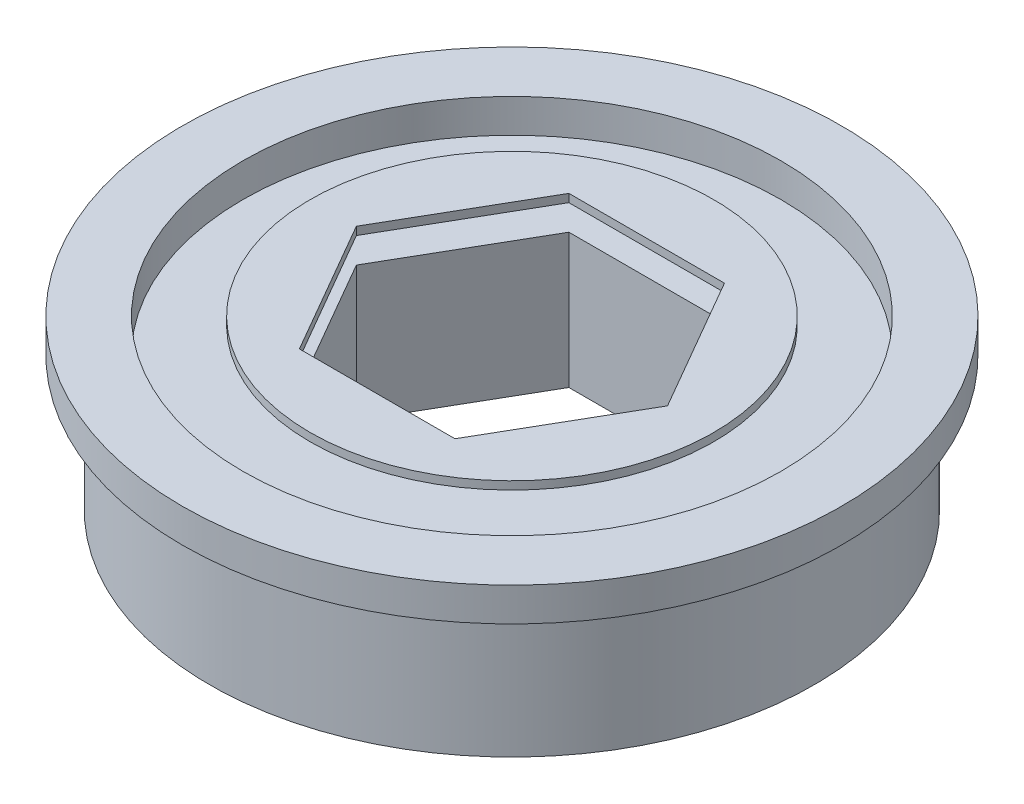
ISO-10303-21;
HEADER;
FILE_DESCRIPTION(('STEP AP214'),'2;1');
FILE_NAME('part.step','',(''),(''),'','','');
FILE_SCHEMA(('AUTOMOTIVE_DESIGN { 1 0 10303 214 1 1 1 1 }'));
ENDSEC;
DATA;
#1=APPLICATION_CONTEXT('core data for automotive mechanical design processes');
#2=APPLICATION_PROTOCOL_DEFINITION('international standard','automotive_design',2000,#1);
#3=PRODUCT_CONTEXT('',#1,'mechanical');
#4=PRODUCT('Part','Part','',(#3));
#5=PRODUCT_RELATED_PRODUCT_CATEGORY('part','',(#4));
#6=PRODUCT_DEFINITION_FORMATION('','',#4);
#7=PRODUCT_DEFINITION_CONTEXT('part definition',#1,'design');
#8=PRODUCT_DEFINITION('design','',#6,#7);
#9=PRODUCT_DEFINITION_SHAPE('','',#8);
#10=(LENGTH_UNIT() NAMED_UNIT(*) SI_UNIT(.MILLI.,.METRE.));
#11=(NAMED_UNIT(*) PLANE_ANGLE_UNIT() SI_UNIT($,.RADIAN.));
#12=(NAMED_UNIT(*) SI_UNIT($,.STERADIAN.) SOLID_ANGLE_UNIT());
#13=UNCERTAINTY_MEASURE_WITH_UNIT(LENGTH_MEASURE(1.E-05),#10,'distance_accuracy_value','');
#14=(GEOMETRIC_REPRESENTATION_CONTEXT(3) GLOBAL_UNCERTAINTY_ASSIGNED_CONTEXT((#13)) GLOBAL_UNIT_ASSIGNED_CONTEXT((#10,
#11,#12)) REPRESENTATION_CONTEXT('',''));
#15=CARTESIAN_POINT('',(0.,0.,0.));
#16=DIRECTION('',(0.,0.,1.));
#17=DIRECTION('',(1.,0.,0.));
#18=AXIS2_PLACEMENT_3D('',#15,#16,#17);
#19=CARTESIAN_POINT('',(0.,7.9375,0.));
#20=DIRECTION('',(0.,-1.,0.));
#21=DIRECTION('',(0.,0.,-1.));
#22=AXIS2_PLACEMENT_3D('',#19,#20,#21);
#23=CYLINDRICAL_SURFACE('',#22,9.525);
#24=CARTESIAN_POINT('',(0.,7.9375,0.));
#25=DIRECTION('',(0.,-1.,0.));
#26=DIRECTION('',(0.,0.,1.));
#27=AXIS2_PLACEMENT_3D('',#24,#25,#26);
#28=CIRCLE('',#27,9.525);
#29=CARTESIAN_POINT('',(0.,7.9375,9.525));
#30=VERTEX_POINT('',#29);
#31=EDGE_CURVE('E168',#30,#30,#28,.T.);
#32=ORIENTED_EDGE('',*,*,#31,.T.);
#33=EDGE_LOOP('',(#32));
#34=FACE_BOUND('',#33,.T.);
#35=CARTESIAN_POINT('',(0.,7.5565,0.));
#36=DIRECTION('',(0.,-1.,0.));
#37=DIRECTION('',(0.,0.,1.));
#38=AXIS2_PLACEMENT_3D('',#35,#36,#37);
#39=CIRCLE('',#38,9.525);
#40=CARTESIAN_POINT('',(0.,7.5565,9.525));
#41=VERTEX_POINT('',#40);
#42=EDGE_CURVE('E154',#41,#41,#39,.T.);
#43=ORIENTED_EDGE('',*,*,#42,.F.);
#44=EDGE_LOOP('',(#43));
#45=FACE_BOUND('',#44,.T.);
#46=ADVANCED_FACE('F51',(#34,#45),#23,.T.);
#47=CARTESIAN_POINT('',(0.,7.9375,0.));
#48=DIRECTION('',(0.,1.,0.));
#49=DIRECTION('',(0.,0.,1.));
#50=AXIS2_PLACEMENT_3D('',#47,#48,#49);
#51=PLANE('',#50);
#52=DIRECTION('',(-1.,0.,0.));
#53=VECTOR('',#52,1.);
#54=CARTESIAN_POINT('',(3.67194771204602,7.9375,6.36));
#55=LINE('',#54,#53);
#56=CARTESIAN_POINT('',(3.67194771204602,7.9375,6.36));
#57=VERTEX_POINT('',#56);
#58=CARTESIAN_POINT('',(-3.67194771204601,7.9375,6.36));
#59=VERTEX_POINT('',#58);
#60=EDGE_CURVE('E119',#57,#59,#55,.T.);
#61=ORIENTED_EDGE('',*,*,#60,.T.);
#62=DIRECTION('',(-0.5,0.,-0.866025403784439));
#63=VECTOR('',#62,1.);
#64=CARTESIAN_POINT('',(-3.67194771204601,7.9375,6.36));
#65=LINE('',#64,#63);
#66=CARTESIAN_POINT('',(-7.34389542409204,7.9375,0.));
#67=VERTEX_POINT('',#66);
#68=EDGE_CURVE('E127',#59,#67,#65,.T.);
#69=ORIENTED_EDGE('',*,*,#68,.T.);
#70=DIRECTION('',(0.5,0.,-0.866025403784439));
#71=VECTOR('',#70,1.);
#72=CARTESIAN_POINT('',(-7.34389542409204,7.9375,0.));
#73=LINE('',#72,#71);
#74=CARTESIAN_POINT('',(-3.67194771204602,7.9375,-6.36));
#75=VERTEX_POINT('',#74);
#76=EDGE_CURVE('E69',#67,#75,#73,.T.);
#77=ORIENTED_EDGE('',*,*,#76,.T.);
#78=DIRECTION('',(1.,0.,0.));
#79=VECTOR('',#78,1.);
#80=CARTESIAN_POINT('',(-3.67194771204602,7.9375,-6.36));
#81=LINE('',#80,#79);
#82=CARTESIAN_POINT('',(3.67194771204602,7.9375,-6.36));
#83=VERTEX_POINT('',#82);
#84=EDGE_CURVE('E142',#75,#83,#81,.T.);
#85=ORIENTED_EDGE('',*,*,#84,.T.);
#86=DIRECTION('',(0.5,0.,0.866025403784438));
#87=VECTOR('',#86,1.);
#88=CARTESIAN_POINT('',(3.67194771204602,7.9375,-6.36));
#89=LINE('',#88,#87);
#90=CARTESIAN_POINT('',(7.34389542409204,7.9375,0.));
#91=VERTEX_POINT('',#90);
#92=EDGE_CURVE('E146',#83,#91,#89,.T.);
#93=ORIENTED_EDGE('',*,*,#92,.T.);
#94=DIRECTION('',(-0.5,0.,0.866025403784439));
#95=VECTOR('',#94,1.);
#96=CARTESIAN_POINT('',(7.34389542409204,7.9375,0.));
#97=LINE('',#96,#95);
#98=EDGE_CURVE('E124',#91,#57,#97,.T.);
#99=ORIENTED_EDGE('',*,*,#98,.T.);
#100=EDGE_LOOP('',(#61,#69,#77,#85,#93,#99));
#101=FACE_BOUND('',#100,.T.);
#102=ORIENTED_EDGE('',*,*,#31,.F.);
#103=EDGE_LOOP('',(#102));
#104=FACE_BOUND('',#103,.T.);
#105=ADVANCED_FACE('F132',(#101,#104),#51,.T.);
#106=CARTESIAN_POINT('',(0.,7.5565,0.));
#107=DIRECTION('',(0.,1.,0.));
#108=DIRECTION('',(0.,0.,1.));
#109=AXIS2_PLACEMENT_3D('',#106,#107,#108);
#110=PLANE('',#109);
#111=DIRECTION('',(0.5,0.,0.866025403784439));
#112=VECTOR('',#111,1.);
#113=CARTESIAN_POINT('',(-5.50792156806903,7.5565,3.18));
#114=LINE('',#113,#112);
#115=CARTESIAN_POINT('',(-7.34389542409204,7.5565,0.));
#116=VERTEX_POINT('',#115);
#117=CARTESIAN_POINT('',(-3.67194771204601,7.5565,6.36));
#118=VERTEX_POINT('',#117);
#119=EDGE_CURVE('E172',#116,#118,#114,.T.);
#120=ORIENTED_EDGE('',*,*,#119,.T.);
#121=DIRECTION('',(1.,0.,0.));
#122=VECTOR('',#121,1.);
#123=CARTESIAN_POINT('',(0.,7.5565,6.36));
#124=LINE('',#123,#122);
#125=CARTESIAN_POINT('',(3.67194771204602,7.5565,6.36));
#126=VERTEX_POINT('',#125);
#127=EDGE_CURVE('E12',#118,#126,#124,.T.);
#128=ORIENTED_EDGE('',*,*,#127,.T.);
#129=DIRECTION('',(0.5,0.,-0.866025403784439));
#130=VECTOR('',#129,1.);
#131=CARTESIAN_POINT('',(5.50792156806903,7.5565,3.18));
#132=LINE('',#131,#130);
#133=CARTESIAN_POINT('',(7.34389542409204,7.5565,0.));
#134=VERTEX_POINT('',#133);
#135=EDGE_CURVE('E59',#126,#134,#132,.T.);
#136=ORIENTED_EDGE('',*,*,#135,.T.);
#137=DIRECTION('',(-0.5,0.,-0.866025403784439));
#138=VECTOR('',#137,1.);
#139=CARTESIAN_POINT('',(5.50792156806903,7.5565,-3.18));
#140=LINE('',#139,#138);
#141=CARTESIAN_POINT('',(3.67194771204602,7.5565,-6.36));
#142=VERTEX_POINT('',#141);
#143=EDGE_CURVE('E186',#134,#142,#140,.T.);
#144=ORIENTED_EDGE('',*,*,#143,.T.);
#145=DIRECTION('',(-1.,0.,0.));
#146=VECTOR('',#145,1.);
#147=CARTESIAN_POINT('',(0.,7.5565,-6.36));
#148=LINE('',#147,#146);
#149=CARTESIAN_POINT('',(-3.67194771204602,7.5565,-6.36));
#150=VERTEX_POINT('',#149);
#151=EDGE_CURVE('E182',#142,#150,#148,.T.);
#152=ORIENTED_EDGE('',*,*,#151,.T.);
#153=DIRECTION('',(-0.5,0.,0.866025403784439));
#154=VECTOR('',#153,1.);
#155=CARTESIAN_POINT('',(-5.50792156806903,7.5565,-3.18));
#156=LINE('',#155,#154);
#157=EDGE_CURVE('E178',#150,#116,#156,.T.);
#158=ORIENTED_EDGE('',*,*,#157,.T.);
#159=EDGE_LOOP('',(#120,#128,#136,#144,#152,#158));
#160=FACE_BOUND('',#159,.T.);
#161=ORIENTED_EDGE('',*,*,#42,.T.);
#162=EDGE_LOOP('',(#161));
#163=FACE_BOUND('',#162,.T.);
#164=ADVANCED_FACE('F192',(#160,#163),#110,.F.);
#165=CARTESIAN_POINT('',(3.67194771204602,7.9375,6.36));
#166=DIRECTION('',(0.,0.,1.));
#167=DIRECTION('',(1.,0.,0.));
#168=AXIS2_PLACEMENT_3D('',#165,#166,#167);
#169=PLANE('',#168);
#170=DIRECTION('',(0.,-1.,0.));
#171=VECTOR('',#170,1.);
#172=CARTESIAN_POINT('',(-3.67194771204601,7.9375,6.36));
#173=LINE('',#172,#171);
#174=EDGE_CURVE('E80',#59,#118,#173,.T.);
#175=ORIENTED_EDGE('',*,*,#174,.F.);
#176=ORIENTED_EDGE('',*,*,#60,.F.);
#177=DIRECTION('',(0.,-1.,0.));
#178=VECTOR('',#177,1.);
#179=CARTESIAN_POINT('',(3.67194771204602,7.9375,6.36));
#180=LINE('',#179,#178);
#181=EDGE_CURVE('E151',#57,#126,#180,.T.);
#182=ORIENTED_EDGE('',*,*,#181,.T.);
#183=ORIENTED_EDGE('',*,*,#127,.F.);
#184=EDGE_LOOP('',(#175,#176,#182,#183));
#185=FACE_BOUND('',#184,.T.);
#186=ADVANCED_FACE('F116',(#185),#169,.F.);
#187=CARTESIAN_POINT('',(7.34389542409204,7.9375,0.));
#188=DIRECTION('',(0.866025403784439,0.,0.5));
#189=DIRECTION('',(0.5,0.,-0.866025403784439));
#190=AXIS2_PLACEMENT_3D('',#187,#188,#189);
#191=PLANE('',#190);
#192=ORIENTED_EDGE('',*,*,#181,.F.);
#193=ORIENTED_EDGE('',*,*,#98,.F.);
#194=DIRECTION('',(0.,-1.,0.));
#195=VECTOR('',#194,1.);
#196=CARTESIAN_POINT('',(7.34389542409204,7.9375,0.));
#197=LINE('',#196,#195);
#198=EDGE_CURVE('E155',#91,#134,#197,.T.);
#199=ORIENTED_EDGE('',*,*,#198,.T.);
#200=ORIENTED_EDGE('',*,*,#135,.F.);
#201=EDGE_LOOP('',(#192,#193,#199,#200));
#202=FACE_BOUND('',#201,.T.);
#203=ADVANCED_FACE('F195',(#202),#191,.F.);
#204=CARTESIAN_POINT('',(3.67194771204602,7.9375,-6.36));
#205=DIRECTION('',(0.866025403784439,0.,-0.5));
#206=DIRECTION('',(-0.5,0.,-0.866025403784439));
#207=AXIS2_PLACEMENT_3D('',#204,#205,#206);
#208=PLANE('',#207);
#209=ORIENTED_EDGE('',*,*,#198,.F.);
#210=ORIENTED_EDGE('',*,*,#92,.F.);
#211=DIRECTION('',(0.,-1.,0.));
#212=VECTOR('',#211,1.);
#213=CARTESIAN_POINT('',(3.67194771204602,7.9375,-6.36));
#214=LINE('',#213,#212);
#215=EDGE_CURVE('E159',#83,#142,#214,.T.);
#216=ORIENTED_EDGE('',*,*,#215,.T.);
#217=ORIENTED_EDGE('',*,*,#143,.F.);
#218=EDGE_LOOP('',(#209,#210,#216,#217));
#219=FACE_BOUND('',#218,.T.);
#220=ADVANCED_FACE('F198',(#219),#208,.F.);
#221=CARTESIAN_POINT('',(-3.67194771204602,7.9375,-6.36));
#222=DIRECTION('',(0.,0.,-1.));
#223=DIRECTION('',(-1.,0.,0.));
#224=AXIS2_PLACEMENT_3D('',#221,#222,#223);
#225=PLANE('',#224);
#226=ORIENTED_EDGE('',*,*,#215,.F.);
#227=ORIENTED_EDGE('',*,*,#84,.F.);
#228=DIRECTION('',(0.,-1.,0.));
#229=VECTOR('',#228,1.);
#230=CARTESIAN_POINT('',(-3.67194771204602,7.9375,-6.36));
#231=LINE('',#230,#229);
#232=EDGE_CURVE('E163',#75,#150,#231,.T.);
#233=ORIENTED_EDGE('',*,*,#232,.T.);
#234=ORIENTED_EDGE('',*,*,#151,.F.);
#235=EDGE_LOOP('',(#226,#227,#233,#234));
#236=FACE_BOUND('',#235,.T.);
#237=ADVANCED_FACE('F201',(#236),#225,.F.);
#238=CARTESIAN_POINT('',(-7.34389542409204,7.9375,0.));
#239=DIRECTION('',(-0.866025403784439,0.,-0.5));
#240=DIRECTION('',(-0.5,0.,0.866025403784439));
#241=AXIS2_PLACEMENT_3D('',#238,#239,#240);
#242=PLANE('',#241);
#243=ORIENTED_EDGE('',*,*,#232,.F.);
#244=ORIENTED_EDGE('',*,*,#76,.F.);
#245=DIRECTION('',(0.,-1.,0.));
#246=VECTOR('',#245,1.);
#247=CARTESIAN_POINT('',(-7.34389542409204,7.9375,0.));
#248=LINE('',#247,#246);
#249=EDGE_CURVE('E123',#67,#116,#248,.T.);
#250=ORIENTED_EDGE('',*,*,#249,.T.);
#251=ORIENTED_EDGE('',*,*,#157,.F.);
#252=EDGE_LOOP('',(#243,#244,#250,#251));
#253=FACE_BOUND('',#252,.T.);
#254=ADVANCED_FACE('F202',(#253),#242,.F.);
#255=CARTESIAN_POINT('',(-3.67194771204601,7.9375,6.36));
#256=DIRECTION('',(-0.866025403784439,0.,0.5));
#257=DIRECTION('',(0.5,0.,0.866025403784439));
#258=AXIS2_PLACEMENT_3D('',#255,#256,#257);
#259=PLANE('',#258);
#260=ORIENTED_EDGE('',*,*,#249,.F.);
#261=ORIENTED_EDGE('',*,*,#68,.F.);
#262=ORIENTED_EDGE('',*,*,#174,.T.);
#263=ORIENTED_EDGE('',*,*,#119,.F.);
#264=EDGE_LOOP('',(#260,#261,#262,#263));
#265=FACE_BOUND('',#264,.T.);
#266=ADVANCED_FACE('F128',(#265),#259,.F.);
#267=CLOSED_SHELL('',(#46,#105,#164,#186,#203,#220,#237,#254,#266));
#268=MANIFOLD_SOLID_BREP('B2',#267);
#269=CARTESIAN_POINT('',(0.,6.35,0.));
#270=DIRECTION('',(0.,1.,0.));
#271=DIRECTION('',(0.,0.,1.));
#272=AXIS2_PLACEMENT_3D('',#269,#270,#271);
#273=CYLINDRICAL_SURFACE('',#272,15.5575);
#274=CARTESIAN_POINT('',(0.,6.35,0.));
#275=DIRECTION('',(0.,1.,0.));
#276=DIRECTION('',(0.,0.,1.));
#277=AXIS2_PLACEMENT_3D('',#274,#275,#276);
#278=CIRCLE('',#277,15.5575);
#279=CARTESIAN_POINT('',(0.,6.35,15.5575));
#280=VERTEX_POINT('',#279);
#281=EDGE_CURVE('E49',#280,#280,#278,.T.);
#282=ORIENTED_EDGE('',*,*,#281,.T.);
#283=EDGE_LOOP('',(#282));
#284=FACE_BOUND('',#283,.T.);
#285=CARTESIAN_POINT('',(0.,7.9375,0.));
#286=DIRECTION('',(0.,1.,0.));
#287=DIRECTION('',(0.,0.,1.));
#288=AXIS2_PLACEMENT_3D('',#285,#286,#287);
#289=CIRCLE('',#288,15.5575);
#290=CARTESIAN_POINT('',(0.,7.9375,15.5575));
#291=VERTEX_POINT('',#290);
#292=EDGE_CURVE('E288',#291,#291,#289,.T.);
#293=ORIENTED_EDGE('',*,*,#292,.F.);
#294=EDGE_LOOP('',(#293));
#295=FACE_BOUND('',#294,.T.);
#296=ADVANCED_FACE('F280',(#284,#295),#273,.T.);
#297=CARTESIAN_POINT('',(15.5575,6.35,0.));
#298=DIRECTION('',(0.,-1.,0.));
#299=DIRECTION('',(0.,0.,-1.));
#300=AXIS2_PLACEMENT_3D('',#297,#298,#299);
#301=PLANE('',#300);
#302=CARTESIAN_POINT('',(0.,6.35,0.));
#303=DIRECTION('',(0.,-1.,0.));
#304=DIRECTION('',(0.,0.,-1.));
#305=AXIS2_PLACEMENT_3D('',#302,#303,#304);
#306=CIRCLE('',#305,14.2748);
#307=CARTESIAN_POINT('',(0.,6.35,-14.2748));
#308=VERTEX_POINT('',#307);
#309=EDGE_CURVE('E416',#308,#308,#306,.T.);
#310=ORIENTED_EDGE('',*,*,#309,.F.);
#311=EDGE_LOOP('',(#310));
#312=FACE_BOUND('',#311,.T.);
#313=ORIENTED_EDGE('',*,*,#281,.F.);
#314=EDGE_LOOP('',(#313));
#315=FACE_BOUND('',#314,.T.);
#316=ADVANCED_FACE('F438',(#312,#315),#301,.T.);
#317=CARTESIAN_POINT('',(0.,7.9375,0.));
#318=DIRECTION('',(0.,1.,0.));
#319=DIRECTION('',(0.,0.,1.));
#320=AXIS2_PLACEMENT_3D('',#317,#318,#319);
#321=PLANE('',#320);
#322=CARTESIAN_POINT('',(0.,7.9375,0.));
#323=DIRECTION('',(0.,1.,0.));
#324=DIRECTION('',(0.,0.,1.));
#325=AXIS2_PLACEMENT_3D('',#322,#323,#324);
#326=CIRCLE('',#325,12.7);
#327=CARTESIAN_POINT('',(0.,7.9375,12.7));
#328=VERTEX_POINT('',#327);
#329=EDGE_CURVE('E421',#328,#328,#326,.T.);
#330=ORIENTED_EDGE('',*,*,#329,.F.);
#331=EDGE_LOOP('',(#330));
#332=FACE_BOUND('',#331,.T.);
#333=ORIENTED_EDGE('',*,*,#292,.T.);
#334=EDGE_LOOP('',(#333));
#335=FACE_BOUND('',#334,.T.);
#336=ADVANCED_FACE('F435',(#332,#335),#321,.T.);
#337=CARTESIAN_POINT('',(0.,7.9375,0.));
#338=DIRECTION('',(0.,1.,0.));
#339=DIRECTION('',(0.,0.,1.));
#340=AXIS2_PLACEMENT_3D('',#337,#338,#339);
#341=CYLINDRICAL_SURFACE('',#340,12.7);
#342=CARTESIAN_POINT('',(0.,6.34999999999999,0.));
#343=DIRECTION('',(0.,1.,0.));
#344=DIRECTION('',(0.,0.,1.));
#345=AXIS2_PLACEMENT_3D('',#342,#343,#344);
#346=CIRCLE('',#345,12.7);
#347=CARTESIAN_POINT('',(0.,6.34999999999999,12.7));
#348=VERTEX_POINT('',#347);
#349=EDGE_CURVE('E428',#348,#348,#346,.T.);
#350=ORIENTED_EDGE('',*,*,#349,.F.);
#351=EDGE_LOOP('',(#350));
#352=FACE_BOUND('',#351,.T.);
#353=ORIENTED_EDGE('',*,*,#329,.T.);
#354=EDGE_LOOP('',(#353));
#355=FACE_BOUND('',#354,.T.);
#356=ADVANCED_FACE('F449',(#352,#355),#341,.F.);
#357=CARTESIAN_POINT('',(0.,6.35,0.));
#358=DIRECTION('',(0.,-1.,0.));
#359=DIRECTION('',(0.,0.,-1.));
#360=AXIS2_PLACEMENT_3D('',#357,#358,#359);
#361=PLANE('',#360);
#362=DIRECTION('',(-0.5,0.,0.866025403784439));
#363=VECTOR('',#362,1.);
#364=CARTESIAN_POINT('',(5.50792156806903,6.35,3.18));
#365=LINE('',#364,#363);
#366=CARTESIAN_POINT('',(7.34389542409204,6.35,0.));
#367=VERTEX_POINT('',#366);
#368=CARTESIAN_POINT('',(3.67194771204602,6.35,6.36));
#369=VERTEX_POINT('',#368);
#370=EDGE_CURVE('E408',#367,#369,#365,.T.);
#371=ORIENTED_EDGE('',*,*,#370,.T.);
#372=DIRECTION('',(-1.,0.,0.));
#373=VECTOR('',#372,1.);
#374=CARTESIAN_POINT('',(0.,6.35,6.36));
#375=LINE('',#374,#373);
#376=CARTESIAN_POINT('',(-3.67194771204601,6.35,6.36));
#377=VERTEX_POINT('',#376);
#378=EDGE_CURVE('E412',#369,#377,#375,.T.);
#379=ORIENTED_EDGE('',*,*,#378,.T.);
#380=DIRECTION('',(-0.5,0.,-0.866025403784439));
#381=VECTOR('',#380,1.);
#382=CARTESIAN_POINT('',(-5.50792156806903,6.35,3.18));
#383=LINE('',#382,#381);
#384=CARTESIAN_POINT('',(-7.34389542409204,6.35,0.));
#385=VERTEX_POINT('',#384);
#386=EDGE_CURVE('E386',#377,#385,#383,.T.);
#387=ORIENTED_EDGE('',*,*,#386,.T.);
#388=DIRECTION('',(0.5,0.,-0.866025403784439));
#389=VECTOR('',#388,1.);
#390=CARTESIAN_POINT('',(-5.50792156806903,6.35,-3.18));
#391=LINE('',#390,#389);
#392=CARTESIAN_POINT('',(-3.67194771204602,6.35,-6.36));
#393=VERTEX_POINT('',#392);
#394=EDGE_CURVE('E351',#385,#393,#391,.T.);
#395=ORIENTED_EDGE('',*,*,#394,.T.);
#396=DIRECTION('',(1.,0.,0.));
#397=VECTOR('',#396,1.);
#398=CARTESIAN_POINT('',(0.,6.35,-6.36));
#399=LINE('',#398,#397);
#400=CARTESIAN_POINT('',(3.67194771204602,6.35,-6.36));
#401=VERTEX_POINT('',#400);
#402=EDGE_CURVE('E400',#393,#401,#399,.T.);
#403=ORIENTED_EDGE('',*,*,#402,.T.);
#404=DIRECTION('',(0.5,0.,0.866025403784439));
#405=VECTOR('',#404,1.);
#406=CARTESIAN_POINT('',(5.50792156806903,6.35,-3.18));
#407=LINE('',#406,#405);
#408=EDGE_CURVE('E404',#401,#367,#407,.T.);
#409=ORIENTED_EDGE('',*,*,#408,.T.);
#410=EDGE_LOOP('',(#371,#379,#387,#395,#403,#409));
#411=FACE_BOUND('',#410,.T.);
#412=ORIENTED_EDGE('',*,*,#349,.T.);
#413=EDGE_LOOP('',(#412));
#414=FACE_BOUND('',#413,.T.);
#415=ADVANCED_FACE('F456',(#411,#414),#361,.F.);
#416=CARTESIAN_POINT('',(0.,0.,0.));
#417=DIRECTION('',(0.,1.,0.));
#418=DIRECTION('',(0.,0.,1.));
#419=AXIS2_PLACEMENT_3D('',#416,#417,#418);
#420=CYLINDRICAL_SURFACE('',#419,14.2748);
#421=CARTESIAN_POINT('',(0.,0.,0.));
#422=DIRECTION('',(0.,-1.,0.));
#423=DIRECTION('',(0.,0.,-1.));
#424=AXIS2_PLACEMENT_3D('',#421,#422,#423);
#425=CIRCLE('',#424,14.2748);
#426=CARTESIAN_POINT('',(0.,0.,-14.2748));
#427=VERTEX_POINT('',#426);
#428=EDGE_CURVE('E417',#427,#427,#425,.T.);
#429=ORIENTED_EDGE('',*,*,#428,.F.);
#430=EDGE_LOOP('',(#429));
#431=FACE_BOUND('',#430,.T.);
#432=ORIENTED_EDGE('',*,*,#309,.T.);
#433=EDGE_LOOP('',(#432));
#434=FACE_BOUND('',#433,.T.);
#435=ADVANCED_FACE('F458',(#431,#434),#420,.T.);
#436=CARTESIAN_POINT('',(0.,0.,0.));
#437=DIRECTION('',(0.,-1.,0.));
#438=DIRECTION('',(0.,0.,-1.));
#439=AXIS2_PLACEMENT_3D('',#436,#437,#438);
#440=PLANE('',#439);
#441=DIRECTION('',(-1.,0.,0.));
#442=VECTOR('',#441,1.);
#443=CARTESIAN_POINT('',(3.67194771204602,0.,6.36));
#444=LINE('',#443,#442);
#445=CARTESIAN_POINT('',(3.67194771204602,0.,6.36));
#446=VERTEX_POINT('',#445);
#447=CARTESIAN_POINT('',(-3.67194771204601,0.,6.36));
#448=VERTEX_POINT('',#447);
#449=EDGE_CURVE('E308',#446,#448,#444,.T.);
#450=ORIENTED_EDGE('',*,*,#449,.F.);
#451=DIRECTION('',(-0.5,0.,0.866025403784439));
#452=VECTOR('',#451,1.);
#453=CARTESIAN_POINT('',(7.34389542409204,0.,0.));
#454=LINE('',#453,#452);
#455=CARTESIAN_POINT('',(7.34389542409204,0.,0.));
#456=VERTEX_POINT('',#455);
#457=EDGE_CURVE('E379',#456,#446,#454,.T.);
#458=ORIENTED_EDGE('',*,*,#457,.F.);
#459=DIRECTION('',(0.5,0.,0.866025403784438));
#460=VECTOR('',#459,1.);
#461=CARTESIAN_POINT('',(3.67194771204602,0.,-6.36));
#462=LINE('',#461,#460);
#463=CARTESIAN_POINT('',(3.67194771204602,0.,-6.36));
#464=VERTEX_POINT('',#463);
#465=EDGE_CURVE('E372',#464,#456,#462,.T.);
#466=ORIENTED_EDGE('',*,*,#465,.F.);
#467=DIRECTION('',(1.,0.,0.));
#468=VECTOR('',#467,1.);
#469=CARTESIAN_POINT('',(-3.67194771204602,0.,-6.36));
#470=LINE('',#469,#468);
#471=CARTESIAN_POINT('',(-3.67194771204602,0.,-6.36));
#472=VERTEX_POINT('',#471);
#473=EDGE_CURVE('E367',#472,#464,#470,.T.);
#474=ORIENTED_EDGE('',*,*,#473,.F.);
#475=DIRECTION('',(0.5,0.,-0.866025403784439));
#476=VECTOR('',#475,1.);
#477=CARTESIAN_POINT('',(-7.34389542409204,0.,0.));
#478=LINE('',#477,#476);
#479=CARTESIAN_POINT('',(-7.34389542409204,0.,0.));
#480=VERTEX_POINT('',#479);
#481=EDGE_CURVE('E348',#480,#472,#478,.T.);
#482=ORIENTED_EDGE('',*,*,#481,.F.);
#483=DIRECTION('',(-0.5,0.,-0.866025403784439));
#484=VECTOR('',#483,1.);
#485=CARTESIAN_POINT('',(-3.67194771204601,0.,6.36));
#486=LINE('',#485,#484);
#487=EDGE_CURVE('E358',#448,#480,#486,.T.);
#488=ORIENTED_EDGE('',*,*,#487,.F.);
#489=EDGE_LOOP('',(#450,#458,#466,#474,#482,#488));
#490=FACE_BOUND('',#489,.T.);
#491=ORIENTED_EDGE('',*,*,#428,.T.);
#492=EDGE_LOOP('',(#491));
#493=FACE_BOUND('',#492,.T.);
#494=ADVANCED_FACE('F363',(#490,#493),#440,.T.);
#495=CARTESIAN_POINT('',(3.67194771204602,7.9375,6.36));
#496=DIRECTION('',(0.,0.,1.));
#497=DIRECTION('',(1.,0.,0.));
#498=AXIS2_PLACEMENT_3D('',#495,#496,#497);
#499=PLANE('',#498);
#500=DIRECTION('',(0.,-1.,0.));
#501=VECTOR('',#500,1.);
#502=CARTESIAN_POINT('',(3.67194771204602,7.9375,6.36));
#503=LINE('',#502,#501);
#504=EDGE_CURVE('E383',#369,#446,#503,.T.);
#505=ORIENTED_EDGE('',*,*,#504,.T.);
#506=ORIENTED_EDGE('',*,*,#449,.T.);
#507=DIRECTION('',(0.,-1.,0.));
#508=VECTOR('',#507,1.);
#509=CARTESIAN_POINT('',(-3.67194771204601,7.9375,6.36));
#510=LINE('',#509,#508);
#511=EDGE_CURVE('E355',#377,#448,#510,.T.);
#512=ORIENTED_EDGE('',*,*,#511,.F.);
#513=ORIENTED_EDGE('',*,*,#378,.F.);
#514=EDGE_LOOP('',(#505,#506,#512,#513));
#515=FACE_BOUND('',#514,.T.);
#516=ADVANCED_FACE('F467',(#515),#499,.F.);
#517=CARTESIAN_POINT('',(7.34389542409204,7.9375,0.));
#518=DIRECTION('',(0.866025403784439,0.,0.5));
#519=DIRECTION('',(0.5,0.,-0.866025403784439));
#520=AXIS2_PLACEMENT_3D('',#517,#518,#519);
#521=PLANE('',#520);
#522=DIRECTION('',(0.,-1.,0.));
#523=VECTOR('',#522,1.);
#524=CARTESIAN_POINT('',(7.34389542409204,7.9375,0.));
#525=LINE('',#524,#523);
#526=EDGE_CURVE('E387',#367,#456,#525,.T.);
#527=ORIENTED_EDGE('',*,*,#526,.T.);
#528=ORIENTED_EDGE('',*,*,#457,.T.);
#529=ORIENTED_EDGE('',*,*,#504,.F.);
#530=ORIENTED_EDGE('',*,*,#370,.F.);
#531=EDGE_LOOP('',(#527,#528,#529,#530));
#532=FACE_BOUND('',#531,.T.);
#533=ADVANCED_FACE('F470',(#532),#521,.F.);
#534=CARTESIAN_POINT('',(3.67194771204602,7.9375,-6.36));
#535=DIRECTION('',(0.866025403784439,0.,-0.5));
#536=DIRECTION('',(-0.5,0.,-0.866025403784439));
#537=AXIS2_PLACEMENT_3D('',#534,#535,#536);
#538=PLANE('',#537);
#539=DIRECTION('',(0.,-1.,0.));
#540=VECTOR('',#539,1.);
#541=CARTESIAN_POINT('',(3.67194771204602,7.9375,-6.36));
#542=LINE('',#541,#540);
#543=EDGE_CURVE('E390',#401,#464,#542,.T.);
#544=ORIENTED_EDGE('',*,*,#543,.T.);
#545=ORIENTED_EDGE('',*,*,#465,.T.);
#546=ORIENTED_EDGE('',*,*,#526,.F.);
#547=ORIENTED_EDGE('',*,*,#408,.F.);
#548=EDGE_LOOP('',(#544,#545,#546,#547));
#549=FACE_BOUND('',#548,.T.);
#550=ADVANCED_FACE('F478',(#549),#538,.F.);
#551=CARTESIAN_POINT('',(-3.67194771204602,7.9375,-6.36));
#552=DIRECTION('',(0.,0.,-1.));
#553=DIRECTION('',(-1.,0.,0.));
#554=AXIS2_PLACEMENT_3D('',#551,#552,#553);
#555=PLANE('',#554);
#556=DIRECTION('',(0.,-1.,0.));
#557=VECTOR('',#556,1.);
#558=CARTESIAN_POINT('',(-3.67194771204602,7.9375,-6.36));
#559=LINE('',#558,#557);
#560=EDGE_CURVE('E354',#393,#472,#559,.T.);
#561=ORIENTED_EDGE('',*,*,#560,.T.);
#562=ORIENTED_EDGE('',*,*,#473,.T.);
#563=ORIENTED_EDGE('',*,*,#543,.F.);
#564=ORIENTED_EDGE('',*,*,#402,.F.);
#565=EDGE_LOOP('',(#561,#562,#563,#564));
#566=FACE_BOUND('',#565,.T.);
#567=ADVANCED_FACE('F475',(#566),#555,.F.);
#568=CARTESIAN_POINT('',(-7.34389542409204,7.9375,0.));
#569=DIRECTION('',(-0.866025403784439,0.,-0.5));
#570=DIRECTION('',(-0.5,0.,0.866025403784439));
#571=AXIS2_PLACEMENT_3D('',#568,#569,#570);
#572=PLANE('',#571);
#573=DIRECTION('',(0.,-1.,0.));
#574=VECTOR('',#573,1.);
#575=CARTESIAN_POINT('',(-7.34389542409204,7.9375,0.));
#576=LINE('',#575,#574);
#577=EDGE_CURVE('E298',#385,#480,#576,.T.);
#578=ORIENTED_EDGE('',*,*,#577,.T.);
#579=ORIENTED_EDGE('',*,*,#481,.T.);
#580=ORIENTED_EDGE('',*,*,#560,.F.);
#581=ORIENTED_EDGE('',*,*,#394,.F.);
#582=EDGE_LOOP('',(#578,#579,#580,#581));
#583=FACE_BOUND('',#582,.T.);
#584=ADVANCED_FACE('F345',(#583),#572,.F.);
#585=CARTESIAN_POINT('',(-3.67194771204601,7.9375,6.36));
#586=DIRECTION('',(-0.866025403784439,0.,0.5));
#587=DIRECTION('',(0.5,0.,0.866025403784439));
#588=AXIS2_PLACEMENT_3D('',#585,#586,#587);
#589=PLANE('',#588);
#590=ORIENTED_EDGE('',*,*,#511,.T.);
#591=ORIENTED_EDGE('',*,*,#487,.T.);
#592=ORIENTED_EDGE('',*,*,#577,.F.);
#593=ORIENTED_EDGE('',*,*,#386,.F.);
#594=EDGE_LOOP('',(#590,#591,#592,#593));
#595=FACE_BOUND('',#594,.T.);
#596=ADVANCED_FACE('F359',(#595),#589,.F.);
#597=CLOSED_SHELL('',(#296,#316,#336,#356,#415,#435,#494,#516,#533,#550,#567,#584,#596));
#598=MANIFOLD_SOLID_BREP('B6',#597);
#599=ADVANCED_BREP_SHAPE_REPRESENTATION('',(#18,#268,#598),#14);
#600=SHAPE_DEFINITION_REPRESENTATION(#9,#599);
ENDSEC;
END-ISO-10303-21;
